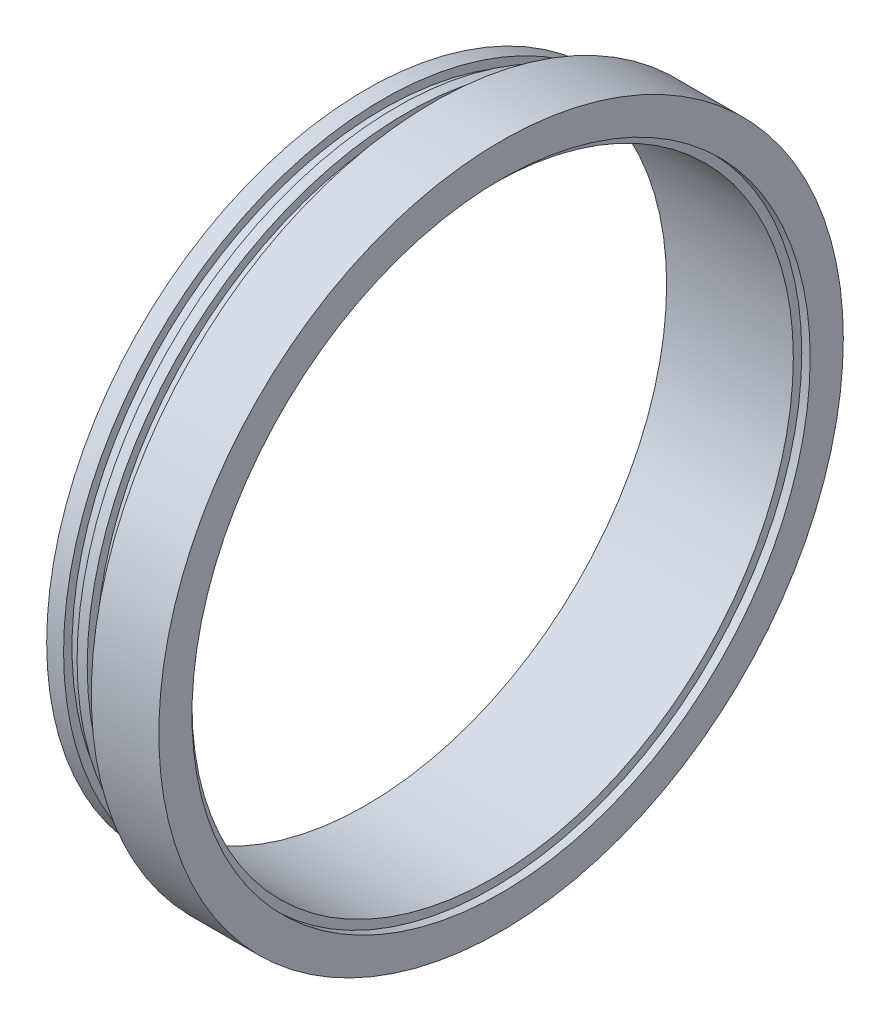
ISO-10303-21;
HEADER;
FILE_DESCRIPTION(('STEP AP214'),'2;1');
FILE_NAME('part.step','',(''),(''),'','','');
FILE_SCHEMA(('AUTOMOTIVE_DESIGN { 1 0 10303 214 1 1 1 1 }'));
ENDSEC;
DATA;
#1=APPLICATION_CONTEXT('core data for automotive mechanical design processes');
#2=APPLICATION_PROTOCOL_DEFINITION('international standard','automotive_design',2000,#1);
#3=PRODUCT_CONTEXT('',#1,'mechanical');
#4=PRODUCT('Part','Part','',(#3));
#5=PRODUCT_RELATED_PRODUCT_CATEGORY('part','',(#4));
#6=PRODUCT_DEFINITION_FORMATION('','',#4);
#7=PRODUCT_DEFINITION_CONTEXT('part definition',#1,'design');
#8=PRODUCT_DEFINITION('design','',#6,#7);
#9=PRODUCT_DEFINITION_SHAPE('','',#8);
#10=(LENGTH_UNIT() NAMED_UNIT(*) SI_UNIT(.MILLI.,.METRE.));
#11=(NAMED_UNIT(*) PLANE_ANGLE_UNIT() SI_UNIT($,.RADIAN.));
#12=(NAMED_UNIT(*) SI_UNIT($,.STERADIAN.) SOLID_ANGLE_UNIT());
#13=UNCERTAINTY_MEASURE_WITH_UNIT(LENGTH_MEASURE(1.E-05),#10,'distance_accuracy_value','');
#14=(GEOMETRIC_REPRESENTATION_CONTEXT(3) GLOBAL_UNCERTAINTY_ASSIGNED_CONTEXT((#13)) GLOBAL_UNIT_ASSIGNED_CONTEXT((#10,
#11,#12)) REPRESENTATION_CONTEXT('',''));
#15=CARTESIAN_POINT('',(0.,0.,0.));
#16=DIRECTION('',(0.,0.,1.));
#17=DIRECTION('',(1.,0.,0.));
#18=AXIS2_PLACEMENT_3D('',#15,#16,#17);
#19=CARTESIAN_POINT('',(0.,89.,0.));
#20=DIRECTION('',(-1.,0.,0.));
#21=DIRECTION('',(0.,0.,1.));
#22=AXIS2_PLACEMENT_3D('',#19,#20,#21);
#23=PLANE('',#22);
#24=CARTESIAN_POINT('',(0.,0.,0.));
#25=DIRECTION('',(1.,0.,0.));
#26=DIRECTION('',(0.,0.,-1.));
#27=AXIS2_PLACEMENT_3D('',#24,#25,#26);
#28=CIRCLE('',#27,89.);
#29=CARTESIAN_POINT('',(0.,0.,-89.));
#30=VERTEX_POINT('',#29);
#31=EDGE_CURVE('E107',#30,#30,#28,.T.);
#32=ORIENTED_EDGE('',*,*,#31,.T.);
#33=EDGE_LOOP('',(#32));
#34=FACE_BOUND('',#33,.T.);
#35=CARTESIAN_POINT('',(0.,0.,0.));
#36=DIRECTION('',(1.,0.,0.));
#37=DIRECTION('',(0.,0.,-1.));
#38=AXIS2_PLACEMENT_3D('',#35,#36,#37);
#39=CIRCLE('',#38,94.5);
#40=CARTESIAN_POINT('',(0.,0.,-94.5));
#41=VERTEX_POINT('',#40);
#42=EDGE_CURVE('E10',#41,#41,#39,.T.);
#43=ORIENTED_EDGE('',*,*,#42,.F.);
#44=EDGE_LOOP('',(#43));
#45=FACE_BOUND('',#44,.T.);
#46=ADVANCED_FACE('F39',(#34,#45),#23,.T.);
#47=CARTESIAN_POINT('',(42.,0.,0.));
#48=DIRECTION('',(1.,0.,0.));
#49=DIRECTION('',(0.,0.,-1.));
#50=AXIS2_PLACEMENT_3D('',#47,#48,#49);
#51=CYLINDRICAL_SURFACE('',#50,94.5);
#52=ORIENTED_EDGE('',*,*,#42,.T.);
#53=EDGE_LOOP('',(#52));
#54=FACE_BOUND('',#53,.T.);
#55=CARTESIAN_POINT('',(5.,0.,0.));
#56=DIRECTION('',(1.,0.,0.));
#57=DIRECTION('',(0.,0.,-1.));
#58=AXIS2_PLACEMENT_3D('',#55,#56,#57);
#59=CIRCLE('',#58,94.5);
#60=CARTESIAN_POINT('',(5.,0.,-94.5));
#61=VERTEX_POINT('',#60);
#62=EDGE_CURVE('E46',#61,#61,#59,.T.);
#63=ORIENTED_EDGE('',*,*,#62,.F.);
#64=EDGE_LOOP('',(#63));
#65=FACE_BOUND('',#64,.T.);
#66=ADVANCED_FACE('F125',(#54,#65),#51,.T.);
#67=CARTESIAN_POINT('',(5.,94.5,0.));
#68=DIRECTION('',(1.,0.,0.));
#69=DIRECTION('',(0.,0.,-1.));
#70=AXIS2_PLACEMENT_3D('',#67,#68,#69);
#71=PLANE('',#70);
#72=ORIENTED_EDGE('',*,*,#62,.T.);
#73=EDGE_LOOP('',(#72));
#74=FACE_BOUND('',#73,.T.);
#75=CARTESIAN_POINT('',(5.,0.,0.));
#76=DIRECTION('',(1.,0.,0.));
#77=DIRECTION('',(0.,0.,-1.));
#78=AXIS2_PLACEMENT_3D('',#75,#76,#77);
#79=CIRCLE('',#78,92.);
#80=CARTESIAN_POINT('',(5.,0.,-92.));
#81=VERTEX_POINT('',#80);
#82=EDGE_CURVE('E53',#81,#81,#79,.T.);
#83=ORIENTED_EDGE('',*,*,#82,.F.);
#84=EDGE_LOOP('',(#83));
#85=FACE_BOUND('',#84,.T.);
#86=ADVANCED_FACE('F129',(#74,#85),#71,.T.);
#87=CARTESIAN_POINT('',(42.,0.,0.));
#88=DIRECTION('',(1.,0.,0.));
#89=DIRECTION('',(0.,0.,-1.));
#90=AXIS2_PLACEMENT_3D('',#87,#88,#89);
#91=CYLINDRICAL_SURFACE('',#90,92.);
#92=ORIENTED_EDGE('',*,*,#82,.T.);
#93=EDGE_LOOP('',(#92));
#94=FACE_BOUND('',#93,.T.);
#95=CARTESIAN_POINT('',(9.,0.,0.));
#96=DIRECTION('',(1.,0.,0.));
#97=DIRECTION('',(0.,0.,-1.));
#98=AXIS2_PLACEMENT_3D('',#95,#96,#97);
#99=CIRCLE('',#98,92.);
#100=CARTESIAN_POINT('',(9.,0.,-92.));
#101=VERTEX_POINT('',#100);
#102=EDGE_CURVE('E58',#101,#101,#99,.T.);
#103=ORIENTED_EDGE('',*,*,#102,.F.);
#104=EDGE_LOOP('',(#103));
#105=FACE_BOUND('',#104,.T.);
#106=ADVANCED_FACE('F133',(#94,#105),#91,.T.);
#107=CARTESIAN_POINT('',(9.,92.,0.));
#108=DIRECTION('',(-1.,0.,0.));
#109=DIRECTION('',(0.,0.,1.));
#110=AXIS2_PLACEMENT_3D('',#107,#108,#109);
#111=PLANE('',#110);
#112=ORIENTED_EDGE('',*,*,#102,.T.);
#113=EDGE_LOOP('',(#112));
#114=FACE_BOUND('',#113,.T.);
#115=CARTESIAN_POINT('',(9.,0.,0.));
#116=DIRECTION('',(1.,0.,0.));
#117=DIRECTION('',(0.,0.,-1.));
#118=AXIS2_PLACEMENT_3D('',#115,#116,#117);
#119=CIRCLE('',#118,94.5);
#120=CARTESIAN_POINT('',(9.,0.,-94.5));
#121=VERTEX_POINT('',#120);
#122=EDGE_CURVE('E63',#121,#121,#119,.T.);
#123=ORIENTED_EDGE('',*,*,#122,.F.);
#124=EDGE_LOOP('',(#123));
#125=FACE_BOUND('',#124,.T.);
#126=ADVANCED_FACE('F139',(#114,#125),#111,.T.);
#127=CARTESIAN_POINT('',(42.,0.,0.));
#128=DIRECTION('',(1.,0.,0.));
#129=DIRECTION('',(0.,0.,-1.));
#130=AXIS2_PLACEMENT_3D('',#127,#128,#129);
#131=CYLINDRICAL_SURFACE('',#130,94.5);
#132=ORIENTED_EDGE('',*,*,#122,.T.);
#133=EDGE_LOOP('',(#132));
#134=FACE_BOUND('',#133,.T.);
#135=CARTESIAN_POINT('',(12.,0.,0.));
#136=DIRECTION('',(1.,0.,0.));
#137=DIRECTION('',(0.,0.,-1.));
#138=AXIS2_PLACEMENT_3D('',#135,#136,#137);
#139=CIRCLE('',#138,94.5);
#140=CARTESIAN_POINT('',(12.,0.,-94.5));
#141=VERTEX_POINT('',#140);
#142=EDGE_CURVE('E67',#141,#141,#139,.T.);
#143=ORIENTED_EDGE('',*,*,#142,.F.);
#144=EDGE_LOOP('',(#143));
#145=FACE_BOUND('',#144,.T.);
#146=ADVANCED_FACE('F143',(#134,#145),#131,.T.);
#147=CARTESIAN_POINT('',(12.,94.5,0.));
#148=DIRECTION('',(1.,0.,0.));
#149=DIRECTION('',(0.,0.,-1.));
#150=AXIS2_PLACEMENT_3D('',#147,#148,#149);
#151=PLANE('',#150);
#152=ORIENTED_EDGE('',*,*,#142,.T.);
#153=EDGE_LOOP('',(#152));
#154=FACE_BOUND('',#153,.T.);
#155=CARTESIAN_POINT('',(12.,0.,0.));
#156=DIRECTION('',(1.,0.,0.));
#157=DIRECTION('',(0.,0.,-1.));
#158=AXIS2_PLACEMENT_3D('',#155,#156,#157);
#159=CIRCLE('',#158,92.);
#160=CARTESIAN_POINT('',(12.,0.,-92.));
#161=VERTEX_POINT('',#160);
#162=EDGE_CURVE('E71',#161,#161,#159,.T.);
#163=ORIENTED_EDGE('',*,*,#162,.F.);
#164=EDGE_LOOP('',(#163));
#165=FACE_BOUND('',#164,.T.);
#166=ADVANCED_FACE('F147',(#154,#165),#151,.T.);
#167=CARTESIAN_POINT('',(42.,0.,0.));
#168=DIRECTION('',(1.,0.,0.));
#169=DIRECTION('',(0.,0.,-1.));
#170=AXIS2_PLACEMENT_3D('',#167,#168,#169);
#171=CYLINDRICAL_SURFACE('',#170,92.);
#172=ORIENTED_EDGE('',*,*,#162,.T.);
#173=EDGE_LOOP('',(#172));
#174=FACE_BOUND('',#173,.T.);
#175=CARTESIAN_POINT('',(16.,0.,0.));
#176=DIRECTION('',(1.,0.,0.));
#177=DIRECTION('',(0.,0.,-1.));
#178=AXIS2_PLACEMENT_3D('',#175,#176,#177);
#179=CIRCLE('',#178,92.);
#180=CARTESIAN_POINT('',(16.,0.,-92.));
#181=VERTEX_POINT('',#180);
#182=EDGE_CURVE('E75',#181,#181,#179,.T.);
#183=ORIENTED_EDGE('',*,*,#182,.F.);
#184=EDGE_LOOP('',(#183));
#185=FACE_BOUND('',#184,.T.);
#186=ADVANCED_FACE('F151',(#174,#185),#171,.T.);
#187=CARTESIAN_POINT('',(16.,92.,0.));
#188=DIRECTION('',(-1.,0.,0.));
#189=DIRECTION('',(0.,0.,1.));
#190=AXIS2_PLACEMENT_3D('',#187,#188,#189);
#191=PLANE('',#190);
#192=ORIENTED_EDGE('',*,*,#182,.T.);
#193=EDGE_LOOP('',(#192));
#194=FACE_BOUND('',#193,.T.);
#195=CARTESIAN_POINT('',(16.,0.,0.));
#196=DIRECTION('',(1.,0.,0.));
#197=DIRECTION('',(0.,0.,-1.));
#198=AXIS2_PLACEMENT_3D('',#195,#196,#197);
#199=CIRCLE('',#198,94.5);
#200=CARTESIAN_POINT('',(16.,0.,-94.5));
#201=VERTEX_POINT('',#200);
#202=EDGE_CURVE('E79',#201,#201,#199,.T.);
#203=ORIENTED_EDGE('',*,*,#202,.F.);
#204=EDGE_LOOP('',(#203));
#205=FACE_BOUND('',#204,.T.);
#206=ADVANCED_FACE('F155',(#194,#205),#191,.T.);
#207=CARTESIAN_POINT('',(42.,0.,0.));
#208=DIRECTION('',(1.,0.,0.));
#209=DIRECTION('',(0.,0.,-1.));
#210=AXIS2_PLACEMENT_3D('',#207,#208,#209);
#211=CYLINDRICAL_SURFACE('',#210,94.5);
#212=ORIENTED_EDGE('',*,*,#202,.T.);
#213=EDGE_LOOP('',(#212));
#214=FACE_BOUND('',#213,.T.);
#215=CARTESIAN_POINT('',(20.,0.,0.));
#216=DIRECTION('',(1.,0.,0.));
#217=DIRECTION('',(0.,0.,-1.));
#218=AXIS2_PLACEMENT_3D('',#215,#216,#217);
#219=CIRCLE('',#218,94.5);
#220=CARTESIAN_POINT('',(20.,0.,-94.5));
#221=VERTEX_POINT('',#220);
#222=EDGE_CURVE('E83',#221,#221,#219,.T.);
#223=ORIENTED_EDGE('',*,*,#222,.F.);
#224=EDGE_LOOP('',(#223));
#225=FACE_BOUND('',#224,.T.);
#226=ADVANCED_FACE('F159',(#214,#225),#211,.T.);
#227=CARTESIAN_POINT('',(20.,94.5,0.));
#228=DIRECTION('',(-1.,0.,0.));
#229=DIRECTION('',(0.,0.,1.));
#230=AXIS2_PLACEMENT_3D('',#227,#228,#229);
#231=PLANE('',#230);
#232=ORIENTED_EDGE('',*,*,#222,.T.);
#233=EDGE_LOOP('',(#232));
#234=FACE_BOUND('',#233,.T.);
#235=CARTESIAN_POINT('',(20.,0.,0.));
#236=DIRECTION('',(1.,0.,0.));
#237=DIRECTION('',(0.,0.,-1.));
#238=AXIS2_PLACEMENT_3D('',#235,#236,#237);
#239=CIRCLE('',#238,101.3);
#240=CARTESIAN_POINT('',(20.,0.,-101.3));
#241=VERTEX_POINT('',#240);
#242=EDGE_CURVE('E87',#241,#241,#239,.T.);
#243=ORIENTED_EDGE('',*,*,#242,.F.);
#244=EDGE_LOOP('',(#243));
#245=FACE_BOUND('',#244,.T.);
#246=ADVANCED_FACE('F163',(#234,#245),#231,.T.);
#247=CARTESIAN_POINT('',(42.,0.,0.));
#248=DIRECTION('',(1.,0.,0.));
#249=DIRECTION('',(0.,0.,-1.));
#250=AXIS2_PLACEMENT_3D('',#247,#248,#249);
#251=CYLINDRICAL_SURFACE('',#250,101.3);
#252=ORIENTED_EDGE('',*,*,#242,.T.);
#253=EDGE_LOOP('',(#252));
#254=FACE_BOUND('',#253,.T.);
#255=CARTESIAN_POINT('',(40.,0.,0.));
#256=DIRECTION('',(1.,0.,0.));
#257=DIRECTION('',(0.,0.,-1.));
#258=AXIS2_PLACEMENT_3D('',#255,#256,#257);
#259=CIRCLE('',#258,101.3);
#260=CARTESIAN_POINT('',(40.,0.,-101.3));
#261=VERTEX_POINT('',#260);
#262=EDGE_CURVE('E91',#261,#261,#259,.T.);
#263=ORIENTED_EDGE('',*,*,#262,.F.);
#264=EDGE_LOOP('',(#263));
#265=FACE_BOUND('',#264,.T.);
#266=ADVANCED_FACE('F167',(#254,#265),#251,.T.);
#267=CARTESIAN_POINT('',(40.,101.3,0.));
#268=DIRECTION('',(1.,0.,0.));
#269=DIRECTION('',(0.,0.,-1.));
#270=AXIS2_PLACEMENT_3D('',#267,#268,#269);
#271=PLANE('',#270);
#272=ORIENTED_EDGE('',*,*,#262,.T.);
#273=EDGE_LOOP('',(#272));
#274=FACE_BOUND('',#273,.T.);
#275=CARTESIAN_POINT('',(40.,0.,0.));
#276=DIRECTION('',(1.,0.,0.));
#277=DIRECTION('',(0.,0.,-1.));
#278=AXIS2_PLACEMENT_3D('',#275,#276,#277);
#279=CIRCLE('',#278,91.5);
#280=CARTESIAN_POINT('',(40.,0.,-91.5));
#281=VERTEX_POINT('',#280);
#282=EDGE_CURVE('E95',#281,#281,#279,.T.);
#283=ORIENTED_EDGE('',*,*,#282,.F.);
#284=EDGE_LOOP('',(#283));
#285=FACE_BOUND('',#284,.T.);
#286=ADVANCED_FACE('F171',(#274,#285),#271,.T.);
#287=CARTESIAN_POINT('',(42.,0.,0.));
#288=DIRECTION('',(1.,0.,0.));
#289=DIRECTION('',(0.,0.,-1.));
#290=AXIS2_PLACEMENT_3D('',#287,#288,#289);
#291=CYLINDRICAL_SURFACE('',#290,91.5);
#292=ORIENTED_EDGE('',*,*,#282,.T.);
#293=EDGE_LOOP('',(#292));
#294=FACE_BOUND('',#293,.T.);
#295=CARTESIAN_POINT('',(37.5,0.,0.));
#296=DIRECTION('',(1.,0.,0.));
#297=DIRECTION('',(0.,0.,-1.));
#298=AXIS2_PLACEMENT_3D('',#295,#296,#297);
#299=CIRCLE('',#298,91.5);
#300=CARTESIAN_POINT('',(37.5,0.,-91.5));
#301=VERTEX_POINT('',#300);
#302=EDGE_CURVE('E99',#301,#301,#299,.T.);
#303=ORIENTED_EDGE('',*,*,#302,.F.);
#304=EDGE_LOOP('',(#303));
#305=FACE_BOUND('',#304,.T.);
#306=ADVANCED_FACE('F121',(#294,#305),#291,.F.);
#307=CARTESIAN_POINT('',(37.5,89.,0.));
#308=DIRECTION('',(1.,0.,0.));
#309=DIRECTION('',(0.,0.,-1.));
#310=AXIS2_PLACEMENT_3D('',#307,#308,#309);
#311=PLANE('',#310);
#312=ORIENTED_EDGE('',*,*,#302,.T.);
#313=EDGE_LOOP('',(#312));
#314=FACE_BOUND('',#313,.T.);
#315=CARTESIAN_POINT('',(37.5,0.,0.));
#316=DIRECTION('',(1.,0.,0.));
#317=DIRECTION('',(0.,0.,-1.));
#318=AXIS2_PLACEMENT_3D('',#315,#316,#317);
#319=CIRCLE('',#318,89.);
#320=CARTESIAN_POINT('',(37.5,0.,-89.));
#321=VERTEX_POINT('',#320);
#322=EDGE_CURVE('E103',#321,#321,#319,.T.);
#323=ORIENTED_EDGE('',*,*,#322,.F.);
#324=EDGE_LOOP('',(#323));
#325=FACE_BOUND('',#324,.T.);
#326=ADVANCED_FACE('F115',(#314,#325),#311,.T.);
#327=CARTESIAN_POINT('',(42.,0.,0.));
#328=DIRECTION('',(1.,0.,0.));
#329=DIRECTION('',(0.,0.,-1.));
#330=AXIS2_PLACEMENT_3D('',#327,#328,#329);
#331=CYLINDRICAL_SURFACE('',#330,89.);
#332=ORIENTED_EDGE('',*,*,#322,.T.);
#333=EDGE_LOOP('',(#332));
#334=FACE_BOUND('',#333,.T.);
#335=ORIENTED_EDGE('',*,*,#31,.F.);
#336=EDGE_LOOP('',(#335));
#337=FACE_BOUND('',#336,.T.);
#338=ADVANCED_FACE('F113',(#334,#337),#331,.F.);
#339=CLOSED_SHELL('',(#46,#66,#86,#106,#126,#146,#166,#186,#206,#226,#246,#266,#286,#306,#326,#338));
#340=MANIFOLD_SOLID_BREP('B2',#339);
#341=ADVANCED_BREP_SHAPE_REPRESENTATION('',(#18,#340),#14);
#342=SHAPE_DEFINITION_REPRESENTATION(#9,#341);
ENDSEC;
END-ISO-10303-21;
